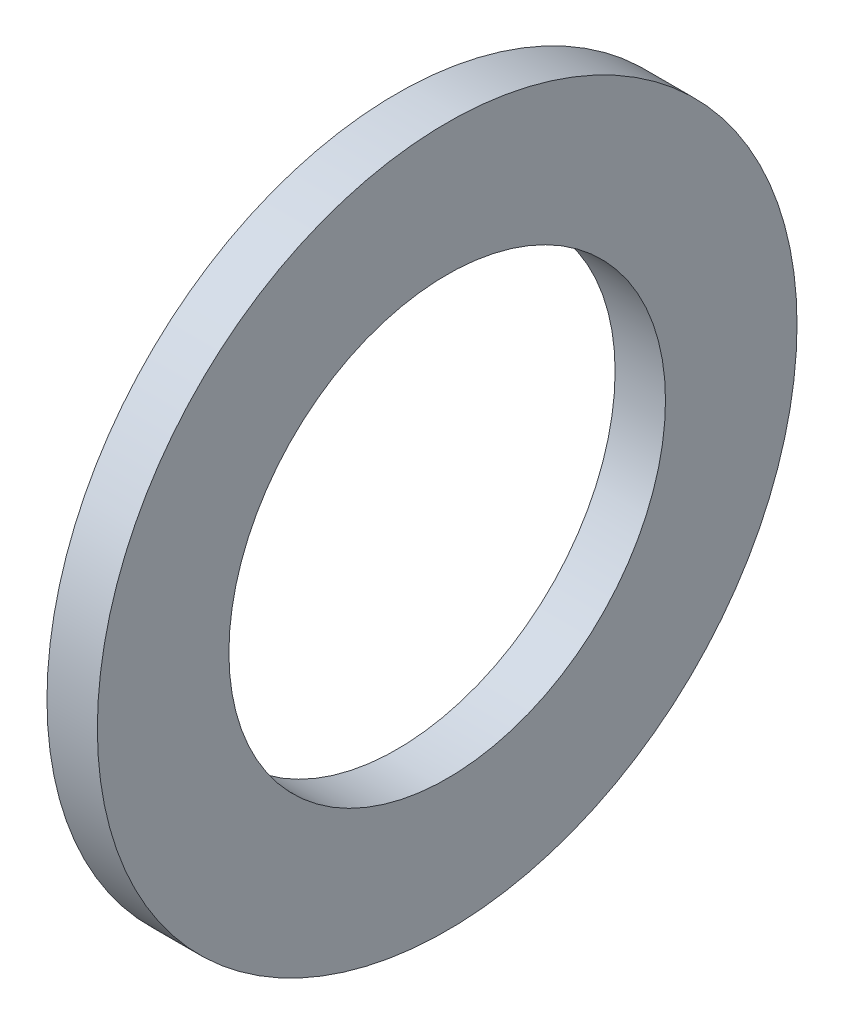
ISO-10303-21;
HEADER;
FILE_DESCRIPTION(('STEP AP214'),'2;1');
FILE_NAME('part.step','',(''),(''),'','','');
FILE_SCHEMA(('AUTOMOTIVE_DESIGN { 1 0 10303 214 1 1 1 1 }'));
ENDSEC;
DATA;
#1=APPLICATION_CONTEXT('core data for automotive mechanical design processes');
#2=APPLICATION_PROTOCOL_DEFINITION('international standard','automotive_design',2000,#1);
#3=PRODUCT_CONTEXT('',#1,'mechanical');
#4=PRODUCT('Part','Part','',(#3));
#5=PRODUCT_RELATED_PRODUCT_CATEGORY('part','',(#4));
#6=PRODUCT_DEFINITION_FORMATION('','',#4);
#7=PRODUCT_DEFINITION_CONTEXT('part definition',#1,'design');
#8=PRODUCT_DEFINITION('design','',#6,#7);
#9=PRODUCT_DEFINITION_SHAPE('','',#8);
#10=(LENGTH_UNIT() NAMED_UNIT(*) SI_UNIT(.MILLI.,.METRE.));
#11=(NAMED_UNIT(*) PLANE_ANGLE_UNIT() SI_UNIT($,.RADIAN.));
#12=(NAMED_UNIT(*) SI_UNIT($,.STERADIAN.) SOLID_ANGLE_UNIT());
#13=UNCERTAINTY_MEASURE_WITH_UNIT(LENGTH_MEASURE(1.E-05),#10,'distance_accuracy_value','');
#14=(GEOMETRIC_REPRESENTATION_CONTEXT(3) GLOBAL_UNCERTAINTY_ASSIGNED_CONTEXT((#13)) GLOBAL_UNIT_ASSIGNED_CONTEXT((#10,
#11,#12)) REPRESENTATION_CONTEXT('',''));
#15=CARTESIAN_POINT('',(0.,0.,0.));
#16=DIRECTION('',(0.,0.,1.));
#17=DIRECTION('',(1.,0.,0.));
#18=AXIS2_PLACEMENT_3D('',#15,#16,#17);
#19=CARTESIAN_POINT('',(0.9144,0.,0.));
#20=DIRECTION('',(1.,0.,0.));
#21=DIRECTION('',(0.,0.,-1.));
#22=AXIS2_PLACEMENT_3D('',#19,#20,#21);
#23=PLANE('',#22);
#24=CARTESIAN_POINT('',(0.9144,0.,0.));
#25=DIRECTION('',(1.,0.,0.));
#26=DIRECTION('',(0.,0.,-1.));
#27=AXIS2_PLACEMENT_3D('',#24,#25,#26);
#28=CIRCLE('',#27,6.35);
#29=CARTESIAN_POINT('',(0.9144,0.,-6.35));
#30=VERTEX_POINT('',#29);
#31=EDGE_CURVE('E10',#30,#30,#28,.T.);
#32=ORIENTED_EDGE('',*,*,#31,.T.);
#33=EDGE_LOOP('',(#32));
#34=FACE_BOUND('',#33,.T.);
#35=CARTESIAN_POINT('',(0.9144,0.,0.));
#36=DIRECTION('',(1.,0.,0.));
#37=DIRECTION('',(0.,0.,-1.));
#38=AXIS2_PLACEMENT_3D('',#35,#36,#37);
#39=CIRCLE('',#38,3.9624);
#40=CARTESIAN_POINT('',(0.9144,0.,-3.9624));
#41=VERTEX_POINT('',#40);
#42=EDGE_CURVE('E41',#41,#41,#39,.T.);
#43=ORIENTED_EDGE('',*,*,#42,.F.);
#44=EDGE_LOOP('',(#43));
#45=FACE_BOUND('',#44,.T.);
#46=ADVANCED_FACE('F30',(#34,#45),#23,.T.);
#47=CARTESIAN_POINT('',(0.,0.,0.));
#48=DIRECTION('',(1.,0.,0.));
#49=DIRECTION('',(0.,0.,-1.));
#50=AXIS2_PLACEMENT_3D('',#47,#48,#49);
#51=PLANE('',#50);
#52=CARTESIAN_POINT('',(0.,0.,0.));
#53=DIRECTION('',(1.,0.,0.));
#54=DIRECTION('',(0.,0.,-1.));
#55=AXIS2_PLACEMENT_3D('',#52,#53,#54);
#56=CIRCLE('',#55,6.35);
#57=CARTESIAN_POINT('',(0.,0.,-6.35));
#58=VERTEX_POINT('',#57);
#59=EDGE_CURVE('E34',#58,#58,#56,.T.);
#60=ORIENTED_EDGE('',*,*,#59,.F.);
#61=EDGE_LOOP('',(#60));
#62=FACE_BOUND('',#61,.T.);
#63=CARTESIAN_POINT('',(0.,0.,0.));
#64=DIRECTION('',(1.,0.,0.));
#65=DIRECTION('',(0.,0.,-1.));
#66=AXIS2_PLACEMENT_3D('',#63,#64,#65);
#67=CIRCLE('',#66,3.9624);
#68=CARTESIAN_POINT('',(0.,0.,-3.9624));
#69=VERTEX_POINT('',#68);
#70=EDGE_CURVE('E43',#69,#69,#67,.T.);
#71=ORIENTED_EDGE('',*,*,#70,.T.);
#72=EDGE_LOOP('',(#71));
#73=FACE_BOUND('',#72,.T.);
#74=ADVANCED_FACE('F53',(#62,#73),#51,.F.);
#75=CARTESIAN_POINT('',(0.9144,0.,0.));
#76=DIRECTION('',(-1.,0.,0.));
#77=DIRECTION('',(0.,0.,1.));
#78=AXIS2_PLACEMENT_3D('',#75,#76,#77);
#79=CYLINDRICAL_SURFACE('',#78,6.35);
#80=ORIENTED_EDGE('',*,*,#31,.F.);
#81=EDGE_LOOP('',(#80));
#82=FACE_BOUND('',#81,.T.);
#83=ORIENTED_EDGE('',*,*,#59,.T.);
#84=EDGE_LOOP('',(#83));
#85=FACE_BOUND('',#84,.T.);
#86=ADVANCED_FACE('F32',(#82,#85),#79,.T.);
#87=CARTESIAN_POINT('',(0.9144,0.,0.));
#88=DIRECTION('',(-1.,0.,0.));
#89=DIRECTION('',(0.,0.,1.));
#90=AXIS2_PLACEMENT_3D('',#87,#88,#89);
#91=CYLINDRICAL_SURFACE('',#90,3.9624);
#92=ORIENTED_EDGE('',*,*,#42,.T.);
#93=EDGE_LOOP('',(#92));
#94=FACE_BOUND('',#93,.T.);
#95=ORIENTED_EDGE('',*,*,#70,.F.);
#96=EDGE_LOOP('',(#95));
#97=FACE_BOUND('',#96,.T.);
#98=ADVANCED_FACE('F49',(#94,#97),#91,.F.);
#99=CLOSED_SHELL('',(#46,#74,#86,#98));
#100=MANIFOLD_SOLID_BREP('B2',#99);
#101=ADVANCED_BREP_SHAPE_REPRESENTATION('',(#18,#100),#14);
#102=SHAPE_DEFINITION_REPRESENTATION(#9,#101);
ENDSEC;
END-ISO-10303-21;
